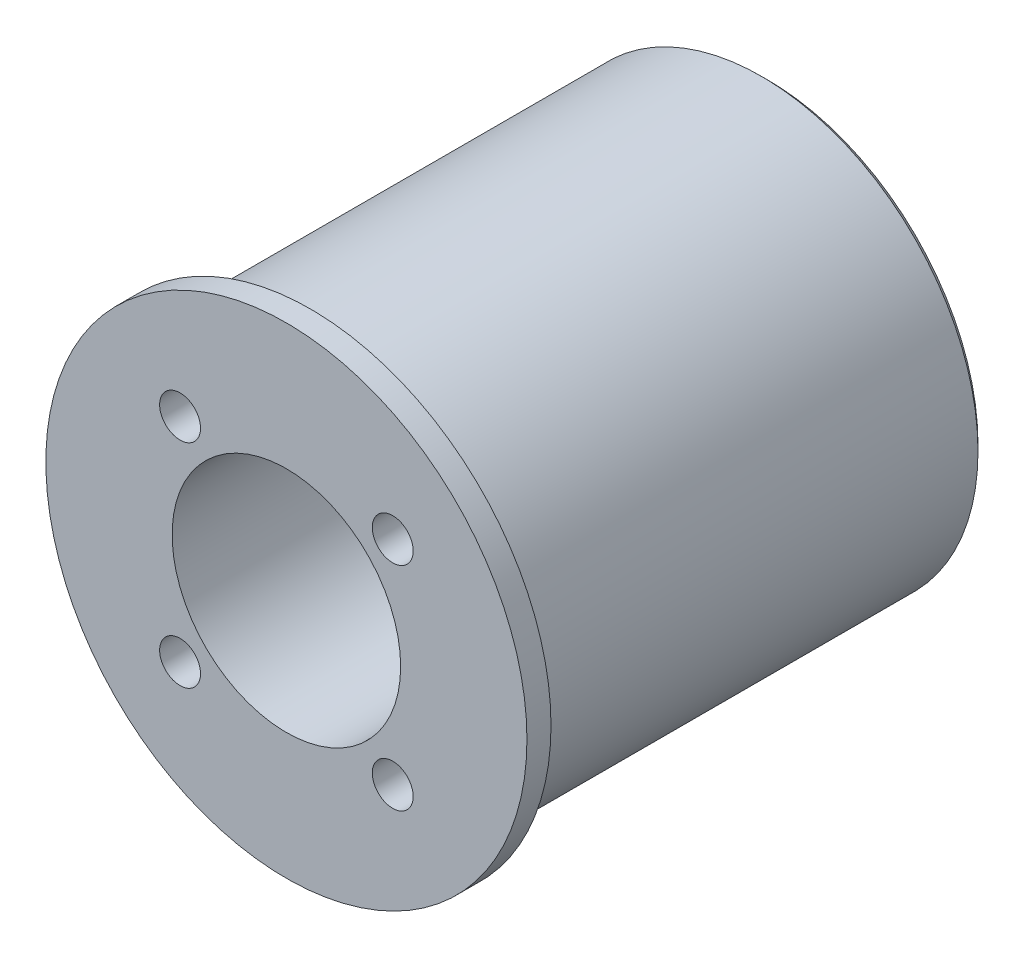
ISO-10303-21;
HEADER;
FILE_DESCRIPTION(('STEP AP214'),'2;1');
FILE_NAME('part.step','',(''),(''),'','','');
FILE_SCHEMA(('AUTOMOTIVE_DESIGN { 1 0 10303 214 1 1 1 1 }'));
ENDSEC;
DATA;
#1=APPLICATION_CONTEXT('core data for automotive mechanical design processes');
#2=APPLICATION_PROTOCOL_DEFINITION('international standard','automotive_design',2000,#1);
#3=PRODUCT_CONTEXT('',#1,'mechanical');
#4=PRODUCT('Part','Part','',(#3));
#5=PRODUCT_RELATED_PRODUCT_CATEGORY('part','',(#4));
#6=PRODUCT_DEFINITION_FORMATION('','',#4);
#7=PRODUCT_DEFINITION_CONTEXT('part definition',#1,'design');
#8=PRODUCT_DEFINITION('design','',#6,#7);
#9=PRODUCT_DEFINITION_SHAPE('','',#8);
#10=(LENGTH_UNIT() NAMED_UNIT(*) SI_UNIT(.MILLI.,.METRE.));
#11=(NAMED_UNIT(*) PLANE_ANGLE_UNIT() SI_UNIT($,.RADIAN.));
#12=(NAMED_UNIT(*) SI_UNIT($,.STERADIAN.) SOLID_ANGLE_UNIT());
#13=UNCERTAINTY_MEASURE_WITH_UNIT(LENGTH_MEASURE(1.E-05),#10,'distance_accuracy_value','');
#14=(GEOMETRIC_REPRESENTATION_CONTEXT(3) GLOBAL_UNCERTAINTY_ASSIGNED_CONTEXT((#13)) GLOBAL_UNIT_ASSIGNED_CONTEXT((#10,
#11,#12)) REPRESENTATION_CONTEXT('',''));
#15=CARTESIAN_POINT('',(0.,0.,0.));
#16=DIRECTION('',(0.,0.,1.));
#17=DIRECTION('',(1.,0.,0.));
#18=AXIS2_PLACEMENT_3D('',#15,#16,#17);
#19=CARTESIAN_POINT('',(0.,0.,40.));
#20=DIRECTION('',(0.,0.,-1.));
#21=DIRECTION('',(-1.,0.,0.));
#22=AXIS2_PLACEMENT_3D('',#19,#20,#21);
#23=CYLINDRICAL_SURFACE('',#22,18.);
#24=CARTESIAN_POINT('',(0.,0.,0.499999999999994));
#25=DIRECTION('',(0.,0.,1.));
#26=DIRECTION('',(1.,0.,0.));
#27=AXIS2_PLACEMENT_3D('',#24,#25,#26);
#28=CIRCLE('',#27,18.);
#29=CARTESIAN_POINT('',(18.,0.,0.499999999999994));
#30=VERTEX_POINT('',#29);
#31=EDGE_CURVE('E43',#30,#30,#28,.T.);
#32=ORIENTED_EDGE('',*,*,#31,.T.);
#33=EDGE_LOOP('',(#32));
#34=FACE_BOUND('',#33,.T.);
#35=CARTESIAN_POINT('',(0.,0.,38.));
#36=DIRECTION('',(0.,0.,1.));
#37=DIRECTION('',(1.,0.,0.));
#38=AXIS2_PLACEMENT_3D('',#35,#36,#37);
#39=CIRCLE('',#38,18.);
#40=CARTESIAN_POINT('',(18.,0.,38.));
#41=VERTEX_POINT('',#40);
#42=EDGE_CURVE('E47',#41,#41,#39,.T.);
#43=ORIENTED_EDGE('',*,*,#42,.F.);
#44=EDGE_LOOP('',(#43));
#45=FACE_BOUND('',#44,.T.);
#46=ADVANCED_FACE('F36',(#34,#45),#23,.T.);
#47=CARTESIAN_POINT('',(0.,0.,0.));
#48=DIRECTION('',(0.,0.,1.));
#49=DIRECTION('',(1.,0.,0.));
#50=AXIS2_PLACEMENT_3D('',#47,#48,#49);
#51=PLANE('',#50);
#52=CARTESIAN_POINT('',(0.,0.,0.));
#53=DIRECTION('',(0.,0.,1.));
#54=DIRECTION('',(1.,0.,0.));
#55=AXIS2_PLACEMENT_3D('',#52,#53,#54);
#56=CIRCLE('',#55,17.5);
#57=CARTESIAN_POINT('',(17.5,0.,0.));
#58=VERTEX_POINT('',#57);
#59=EDGE_CURVE('E11',#58,#58,#56,.F.);
#60=ORIENTED_EDGE('',*,*,#59,.T.);
#61=EDGE_LOOP('',(#60));
#62=FACE_BOUND('',#61,.T.);
#63=CARTESIAN_POINT('',(0.,0.,0.));
#64=DIRECTION('',(0.,0.,-1.));
#65=DIRECTION('',(-1.,0.,0.));
#66=AXIS2_PLACEMENT_3D('',#63,#64,#65);
#67=CIRCLE('',#66,8.);
#68=CARTESIAN_POINT('',(-8.,0.,0.));
#69=VERTEX_POINT('',#68);
#70=EDGE_CURVE('E57',#69,#69,#67,.T.);
#71=ORIENTED_EDGE('',*,*,#70,.F.);
#72=EDGE_LOOP('',(#71));
#73=FACE_BOUND('',#72,.T.);
#74=CARTESIAN_POINT('',(8.83883476483184,-8.83883476483185,0.));
#75=DIRECTION('',(0.,0.,-1.));
#76=DIRECTION('',(-1.,0.,0.));
#77=AXIS2_PLACEMENT_3D('',#74,#75,#76);
#78=CIRCLE('',#77,3.25);
#79=CARTESIAN_POINT('',(5.58883476483185,-8.83883476483185,0.));
#80=VERTEX_POINT('',#79);
#81=EDGE_CURVE('E109',#80,#80,#78,.T.);
#82=ORIENTED_EDGE('',*,*,#81,.F.);
#83=EDGE_LOOP('',(#82));
#84=FACE_BOUND('',#83,.T.);
#85=CARTESIAN_POINT('',(8.83883476483184,8.83883476483184,0.));
#86=DIRECTION('',(0.,0.,-1.));
#87=DIRECTION('',(-1.,0.,0.));
#88=AXIS2_PLACEMENT_3D('',#85,#86,#87);
#89=CIRCLE('',#88,3.25);
#90=CARTESIAN_POINT('',(5.58883476483185,8.83883476483184,0.));
#91=VERTEX_POINT('',#90);
#92=EDGE_CURVE('E97',#91,#91,#89,.T.);
#93=ORIENTED_EDGE('',*,*,#92,.F.);
#94=EDGE_LOOP('',(#93));
#95=FACE_BOUND('',#94,.T.);
#96=CARTESIAN_POINT('',(-8.83883476483185,-8.83883476483185,0.));
#97=DIRECTION('',(0.,0.,-1.));
#98=DIRECTION('',(-1.,0.,0.));
#99=AXIS2_PLACEMENT_3D('',#96,#97,#98);
#100=CIRCLE('',#99,3.25);
#101=CARTESIAN_POINT('',(-12.0888347648318,-8.83883476483185,0.));
#102=VERTEX_POINT('',#101);
#103=EDGE_CURVE('E85',#102,#102,#100,.T.);
#104=ORIENTED_EDGE('',*,*,#103,.F.);
#105=EDGE_LOOP('',(#104));
#106=FACE_BOUND('',#105,.T.);
#107=CARTESIAN_POINT('',(-8.83883476483185,8.83883476483184,0.));
#108=DIRECTION('',(0.,0.,-1.));
#109=DIRECTION('',(-1.,0.,0.));
#110=AXIS2_PLACEMENT_3D('',#107,#108,#109);
#111=CIRCLE('',#110,3.25);
#112=CARTESIAN_POINT('',(-12.0888347648318,8.83883476483184,0.));
#113=VERTEX_POINT('',#112);
#114=EDGE_CURVE('E73',#113,#113,#111,.T.);
#115=ORIENTED_EDGE('',*,*,#114,.F.);
#116=EDGE_LOOP('',(#115));
#117=FACE_BOUND('',#116,.T.);
#118=ADVANCED_FACE('F122',(#62,#73,#84,#95,#106,#117),#51,.F.);
#119=CARTESIAN_POINT('',(0.,0.,38.));
#120=DIRECTION('',(0.,0.,1.));
#121=DIRECTION('',(1.,0.,0.));
#122=AXIS2_PLACEMENT_3D('',#119,#120,#121);
#123=CYLINDRICAL_SURFACE('',#122,20.);
#124=CARTESIAN_POINT('',(0.,0.,38.));
#125=DIRECTION('',(0.,0.,1.));
#126=DIRECTION('',(1.,0.,0.));
#127=AXIS2_PLACEMENT_3D('',#124,#125,#126);
#128=CIRCLE('',#127,20.);
#129=CARTESIAN_POINT('',(20.,0.,38.));
#130=VERTEX_POINT('',#129);
#131=EDGE_CURVE('E51',#130,#130,#128,.T.);
#132=ORIENTED_EDGE('',*,*,#131,.T.);
#133=EDGE_LOOP('',(#132));
#134=FACE_BOUND('',#133,.T.);
#135=CARTESIAN_POINT('',(0.,0.,40.));
#136=DIRECTION('',(0.,0.,1.));
#137=DIRECTION('',(1.,0.,0.));
#138=AXIS2_PLACEMENT_3D('',#135,#136,#137);
#139=CIRCLE('',#138,20.);
#140=CARTESIAN_POINT('',(20.,0.,40.));
#141=VERTEX_POINT('',#140);
#142=EDGE_CURVE('E59',#141,#141,#139,.T.);
#143=ORIENTED_EDGE('',*,*,#142,.F.);
#144=EDGE_LOOP('',(#143));
#145=FACE_BOUND('',#144,.T.);
#146=ADVANCED_FACE('F125',(#134,#145),#123,.T.);
#147=CARTESIAN_POINT('',(0.,0.,38.));
#148=DIRECTION('',(0.,0.,1.));
#149=DIRECTION('',(1.,0.,0.));
#150=AXIS2_PLACEMENT_3D('',#147,#148,#149);
#151=PLANE('',#150);
#152=ORIENTED_EDGE('',*,*,#42,.T.);
#153=EDGE_LOOP('',(#152));
#154=FACE_BOUND('',#153,.T.);
#155=ORIENTED_EDGE('',*,*,#131,.F.);
#156=EDGE_LOOP('',(#155));
#157=FACE_BOUND('',#156,.T.);
#158=ADVANCED_FACE('F160',(#154,#157),#151,.F.);
#159=CARTESIAN_POINT('',(0.,0.,40.));
#160=DIRECTION('',(0.,0.,1.));
#161=DIRECTION('',(1.,0.,0.));
#162=AXIS2_PLACEMENT_3D('',#159,#160,#161);
#163=PLANE('',#162);
#164=CARTESIAN_POINT('',(0.,0.,40.));
#165=DIRECTION('',(0.,0.,1.));
#166=DIRECTION('',(1.,0.,0.));
#167=AXIS2_PLACEMENT_3D('',#164,#165,#166);
#168=CIRCLE('',#167,9.5);
#169=CARTESIAN_POINT('',(9.5,0.,40.));
#170=VERTEX_POINT('',#169);
#171=EDGE_CURVE('E56',#170,#170,#168,.T.);
#172=ORIENTED_EDGE('',*,*,#171,.F.);
#173=EDGE_LOOP('',(#172));
#174=FACE_BOUND('',#173,.T.);
#175=CARTESIAN_POINT('',(8.83883476483184,-8.83883476483185,40.));
#176=DIRECTION('',(0.,0.,-1.));
#177=DIRECTION('',(-1.,0.,0.));
#178=AXIS2_PLACEMENT_3D('',#175,#176,#177);
#179=CIRCLE('',#178,1.69999999999999);
#180=CARTESIAN_POINT('',(7.13883476483185,-8.83883476483185,40.));
#181=VERTEX_POINT('',#180);
#182=EDGE_CURVE('E100',#181,#181,#179,.T.);
#183=ORIENTED_EDGE('',*,*,#182,.T.);
#184=EDGE_LOOP('',(#183));
#185=FACE_BOUND('',#184,.T.);
#186=CARTESIAN_POINT('',(8.83883476483184,8.83883476483184,40.));
#187=DIRECTION('',(0.,0.,-1.));
#188=DIRECTION('',(-1.,0.,0.));
#189=AXIS2_PLACEMENT_3D('',#186,#187,#188);
#190=CIRCLE('',#189,1.69999999999999);
#191=CARTESIAN_POINT('',(7.13883476483185,8.83883476483184,40.));
#192=VERTEX_POINT('',#191);
#193=EDGE_CURVE('E88',#192,#192,#190,.T.);
#194=ORIENTED_EDGE('',*,*,#193,.T.);
#195=EDGE_LOOP('',(#194));
#196=FACE_BOUND('',#195,.T.);
#197=CARTESIAN_POINT('',(-8.83883476483185,-8.83883476483185,40.));
#198=DIRECTION('',(0.,0.,-1.));
#199=DIRECTION('',(-1.,0.,0.));
#200=AXIS2_PLACEMENT_3D('',#197,#198,#199);
#201=CIRCLE('',#200,1.69999999999999);
#202=CARTESIAN_POINT('',(-10.5388347648318,-8.83883476483185,40.));
#203=VERTEX_POINT('',#202);
#204=EDGE_CURVE('E76',#203,#203,#201,.T.);
#205=ORIENTED_EDGE('',*,*,#204,.T.);
#206=EDGE_LOOP('',(#205));
#207=FACE_BOUND('',#206,.T.);
#208=CARTESIAN_POINT('',(-8.83883476483185,8.83883476483184,40.));
#209=DIRECTION('',(0.,0.,-1.));
#210=DIRECTION('',(-1.,0.,0.));
#211=AXIS2_PLACEMENT_3D('',#208,#209,#210);
#212=CIRCLE('',#211,1.69999999999999);
#213=CARTESIAN_POINT('',(-10.5388347648318,8.83883476483184,40.));
#214=VERTEX_POINT('',#213);
#215=EDGE_CURVE('E62',#214,#214,#212,.T.);
#216=ORIENTED_EDGE('',*,*,#215,.T.);
#217=EDGE_LOOP('',(#216));
#218=FACE_BOUND('',#217,.T.);
#219=ORIENTED_EDGE('',*,*,#142,.T.);
#220=EDGE_LOOP('',(#219));
#221=FACE_BOUND('',#220,.T.);
#222=ADVANCED_FACE('F157',(#174,#185,#196,#207,#218,#221),#163,.T.);
#223=CARTESIAN_POINT('',(-8.83883476483185,8.83883476483184,0.));
#224=DIRECTION('',(0.,0.,-1.));
#225=DIRECTION('',(-1.,0.,0.));
#226=AXIS2_PLACEMENT_3D('',#223,#224,#225);
#227=CYLINDRICAL_SURFACE('',#226,1.7);
#228=ORIENTED_EDGE('',*,*,#215,.F.);
#229=EDGE_LOOP('',(#228));
#230=FACE_BOUND('',#229,.T.);
#231=CARTESIAN_POINT('',(-8.83883476483185,8.83883476483184,3.4));
#232=DIRECTION('',(0.,0.,-1.));
#233=DIRECTION('',(-1.,0.,0.));
#234=AXIS2_PLACEMENT_3D('',#231,#232,#233);
#235=CIRCLE('',#234,1.7);
#236=CARTESIAN_POINT('',(-10.5388347648319,8.83883476483184,3.4));
#237=VERTEX_POINT('',#236);
#238=EDGE_CURVE('E67',#237,#237,#235,.T.);
#239=ORIENTED_EDGE('',*,*,#238,.T.);
#240=EDGE_LOOP('',(#239));
#241=FACE_BOUND('',#240,.T.);
#242=ADVANCED_FACE('F148',(#230,#241),#227,.F.);
#243=CARTESIAN_POINT('',(-7.13883476483184,8.83883476483184,3.4));
#244=DIRECTION('',(0.,0.,1.));
#245=DIRECTION('',(1.,0.,0.));
#246=AXIS2_PLACEMENT_3D('',#243,#244,#245);
#247=PLANE('',#246);
#248=ORIENTED_EDGE('',*,*,#238,.F.);
#249=EDGE_LOOP('',(#248));
#250=FACE_BOUND('',#249,.T.);
#251=CARTESIAN_POINT('',(-8.83883476483185,8.83883476483184,3.4));
#252=DIRECTION('',(0.,0.,-1.));
#253=DIRECTION('',(-1.,0.,0.));
#254=AXIS2_PLACEMENT_3D('',#251,#252,#253);
#255=CIRCLE('',#254,3.25);
#256=CARTESIAN_POINT('',(-12.0888347648318,8.83883476483184,3.4));
#257=VERTEX_POINT('',#256);
#258=EDGE_CURVE('E70',#257,#257,#255,.T.);
#259=ORIENTED_EDGE('',*,*,#258,.T.);
#260=EDGE_LOOP('',(#259));
#261=FACE_BOUND('',#260,.T.);
#262=ADVANCED_FACE('F138',(#250,#261),#247,.F.);
#263=CARTESIAN_POINT('',(-8.83883476483185,8.83883476483184,0.));
#264=DIRECTION('',(0.,0.,-1.));
#265=DIRECTION('',(-1.,0.,0.));
#266=AXIS2_PLACEMENT_3D('',#263,#264,#265);
#267=CYLINDRICAL_SURFACE('',#266,3.25);
#268=ORIENTED_EDGE('',*,*,#258,.F.);
#269=EDGE_LOOP('',(#268));
#270=FACE_BOUND('',#269,.T.);
#271=ORIENTED_EDGE('',*,*,#114,.T.);
#272=EDGE_LOOP('',(#271));
#273=FACE_BOUND('',#272,.T.);
#274=ADVANCED_FACE('F135',(#270,#273),#267,.F.);
#275=CARTESIAN_POINT('',(-8.83883476483185,-8.83883476483185,0.));
#276=DIRECTION('',(0.,0.,-1.));
#277=DIRECTION('',(-1.,0.,0.));
#278=AXIS2_PLACEMENT_3D('',#275,#276,#277);
#279=CYLINDRICAL_SURFACE('',#278,1.7);
#280=ORIENTED_EDGE('',*,*,#204,.F.);
#281=EDGE_LOOP('',(#280));
#282=FACE_BOUND('',#281,.T.);
#283=CARTESIAN_POINT('',(-8.83883476483185,-8.83883476483185,3.4));
#284=DIRECTION('',(0.,0.,-1.));
#285=DIRECTION('',(-1.,0.,0.));
#286=AXIS2_PLACEMENT_3D('',#283,#284,#285);
#287=CIRCLE('',#286,1.7);
#288=CARTESIAN_POINT('',(-10.5388347648319,-8.83883476483185,3.4));
#289=VERTEX_POINT('',#288);
#290=EDGE_CURVE('E79',#289,#289,#287,.T.);
#291=ORIENTED_EDGE('',*,*,#290,.T.);
#292=EDGE_LOOP('',(#291));
#293=FACE_BOUND('',#292,.T.);
#294=ADVANCED_FACE('F137',(#282,#293),#279,.F.);
#295=CARTESIAN_POINT('',(-7.13883476483184,-8.83883476483185,3.4));
#296=DIRECTION('',(0.,0.,1.));
#297=DIRECTION('',(1.,0.,0.));
#298=AXIS2_PLACEMENT_3D('',#295,#296,#297);
#299=PLANE('',#298);
#300=ORIENTED_EDGE('',*,*,#290,.F.);
#301=EDGE_LOOP('',(#300));
#302=FACE_BOUND('',#301,.T.);
#303=CARTESIAN_POINT('',(-8.83883476483185,-8.83883476483185,3.4));
#304=DIRECTION('',(0.,0.,-1.));
#305=DIRECTION('',(-1.,0.,0.));
#306=AXIS2_PLACEMENT_3D('',#303,#304,#305);
#307=CIRCLE('',#306,3.25);
#308=CARTESIAN_POINT('',(-12.0888347648318,-8.83883476483185,3.4));
#309=VERTEX_POINT('',#308);
#310=EDGE_CURVE('E82',#309,#309,#307,.T.);
#311=ORIENTED_EDGE('',*,*,#310,.T.);
#312=EDGE_LOOP('',(#311));
#313=FACE_BOUND('',#312,.T.);
#314=ADVANCED_FACE('F145',(#302,#313),#299,.F.);
#315=CARTESIAN_POINT('',(-8.83883476483185,-8.83883476483185,0.));
#316=DIRECTION('',(0.,0.,-1.));
#317=DIRECTION('',(-1.,0.,0.));
#318=AXIS2_PLACEMENT_3D('',#315,#316,#317);
#319=CYLINDRICAL_SURFACE('',#318,3.25);
#320=ORIENTED_EDGE('',*,*,#310,.F.);
#321=EDGE_LOOP('',(#320));
#322=FACE_BOUND('',#321,.T.);
#323=ORIENTED_EDGE('',*,*,#103,.T.);
#324=EDGE_LOOP('',(#323));
#325=FACE_BOUND('',#324,.T.);
#326=ADVANCED_FACE('F206',(#322,#325),#319,.F.);
#327=CARTESIAN_POINT('',(8.83883476483184,8.83883476483184,0.));
#328=DIRECTION('',(0.,0.,-1.));
#329=DIRECTION('',(-1.,0.,0.));
#330=AXIS2_PLACEMENT_3D('',#327,#328,#329);
#331=CYLINDRICAL_SURFACE('',#330,1.7);
#332=ORIENTED_EDGE('',*,*,#193,.F.);
#333=EDGE_LOOP('',(#332));
#334=FACE_BOUND('',#333,.T.);
#335=CARTESIAN_POINT('',(8.83883476483184,8.83883476483184,3.4));
#336=DIRECTION('',(0.,0.,-1.));
#337=DIRECTION('',(-1.,0.,0.));
#338=AXIS2_PLACEMENT_3D('',#335,#336,#337);
#339=CIRCLE('',#338,1.7);
#340=CARTESIAN_POINT('',(7.13883476483184,8.83883476483184,3.4));
#341=VERTEX_POINT('',#340);
#342=EDGE_CURVE('E91',#341,#341,#339,.T.);
#343=ORIENTED_EDGE('',*,*,#342,.T.);
#344=EDGE_LOOP('',(#343));
#345=FACE_BOUND('',#344,.T.);
#346=ADVANCED_FACE('F216',(#334,#345),#331,.F.);
#347=CARTESIAN_POINT('',(10.5388347648318,8.83883476483184,3.4));
#348=DIRECTION('',(0.,0.,1.));
#349=DIRECTION('',(1.,0.,0.));
#350=AXIS2_PLACEMENT_3D('',#347,#348,#349);
#351=PLANE('',#350);
#352=ORIENTED_EDGE('',*,*,#342,.F.);
#353=EDGE_LOOP('',(#352));
#354=FACE_BOUND('',#353,.T.);
#355=CARTESIAN_POINT('',(8.83883476483184,8.83883476483184,3.4));
#356=DIRECTION('',(0.,0.,-1.));
#357=DIRECTION('',(-1.,0.,0.));
#358=AXIS2_PLACEMENT_3D('',#355,#356,#357);
#359=CIRCLE('',#358,3.25);
#360=CARTESIAN_POINT('',(5.58883476483184,8.83883476483184,3.4));
#361=VERTEX_POINT('',#360);
#362=EDGE_CURVE('E94',#361,#361,#359,.T.);
#363=ORIENTED_EDGE('',*,*,#362,.T.);
#364=EDGE_LOOP('',(#363));
#365=FACE_BOUND('',#364,.T.);
#366=ADVANCED_FACE('F226',(#354,#365),#351,.F.);
#367=CARTESIAN_POINT('',(8.83883476483184,8.83883476483184,0.));
#368=DIRECTION('',(0.,0.,-1.));
#369=DIRECTION('',(-1.,0.,0.));
#370=AXIS2_PLACEMENT_3D('',#367,#368,#369);
#371=CYLINDRICAL_SURFACE('',#370,3.25);
#372=ORIENTED_EDGE('',*,*,#362,.F.);
#373=EDGE_LOOP('',(#372));
#374=FACE_BOUND('',#373,.T.);
#375=ORIENTED_EDGE('',*,*,#92,.T.);
#376=EDGE_LOOP('',(#375));
#377=FACE_BOUND('',#376,.T.);
#378=ADVANCED_FACE('F236',(#374,#377),#371,.F.);
#379=CARTESIAN_POINT('',(8.83883476483184,-8.83883476483185,0.));
#380=DIRECTION('',(0.,0.,-1.));
#381=DIRECTION('',(-1.,0.,0.));
#382=AXIS2_PLACEMENT_3D('',#379,#380,#381);
#383=CYLINDRICAL_SURFACE('',#382,1.7);
#384=ORIENTED_EDGE('',*,*,#182,.F.);
#385=EDGE_LOOP('',(#384));
#386=FACE_BOUND('',#385,.T.);
#387=CARTESIAN_POINT('',(8.83883476483184,-8.83883476483185,3.4));
#388=DIRECTION('',(0.,0.,-1.));
#389=DIRECTION('',(-1.,0.,0.));
#390=AXIS2_PLACEMENT_3D('',#387,#388,#389);
#391=CIRCLE('',#390,1.7);
#392=CARTESIAN_POINT('',(7.13883476483184,-8.83883476483185,3.4));
#393=VERTEX_POINT('',#392);
#394=EDGE_CURVE('E103',#393,#393,#391,.T.);
#395=ORIENTED_EDGE('',*,*,#394,.T.);
#396=EDGE_LOOP('',(#395));
#397=FACE_BOUND('',#396,.T.);
#398=ADVANCED_FACE('F246',(#386,#397),#383,.F.);
#399=CARTESIAN_POINT('',(10.5388347648318,-8.83883476483185,3.4));
#400=DIRECTION('',(0.,0.,1.));
#401=DIRECTION('',(1.,0.,0.));
#402=AXIS2_PLACEMENT_3D('',#399,#400,#401);
#403=PLANE('',#402);
#404=ORIENTED_EDGE('',*,*,#394,.F.);
#405=EDGE_LOOP('',(#404));
#406=FACE_BOUND('',#405,.T.);
#407=CARTESIAN_POINT('',(8.83883476483184,-8.83883476483185,3.4));
#408=DIRECTION('',(0.,0.,-1.));
#409=DIRECTION('',(-1.,0.,0.));
#410=AXIS2_PLACEMENT_3D('',#407,#408,#409);
#411=CIRCLE('',#410,3.25);
#412=CARTESIAN_POINT('',(5.58883476483184,-8.83883476483185,3.4));
#413=VERTEX_POINT('',#412);
#414=EDGE_CURVE('E106',#413,#413,#411,.T.);
#415=ORIENTED_EDGE('',*,*,#414,.T.);
#416=EDGE_LOOP('',(#415));
#417=FACE_BOUND('',#416,.T.);
#418=ADVANCED_FACE('F256',(#406,#417),#403,.F.);
#419=CARTESIAN_POINT('',(8.83883476483184,-8.83883476483185,0.));
#420=DIRECTION('',(0.,0.,-1.));
#421=DIRECTION('',(-1.,0.,0.));
#422=AXIS2_PLACEMENT_3D('',#419,#420,#421);
#423=CYLINDRICAL_SURFACE('',#422,3.25);
#424=ORIENTED_EDGE('',*,*,#414,.F.);
#425=EDGE_LOOP('',(#424));
#426=FACE_BOUND('',#425,.T.);
#427=ORIENTED_EDGE('',*,*,#81,.T.);
#428=EDGE_LOOP('',(#427));
#429=FACE_BOUND('',#428,.T.);
#430=ADVANCED_FACE('F266',(#426,#429),#423,.F.);
#431=CARTESIAN_POINT('',(0.,0.,5.));
#432=DIRECTION('',(0.,0.,1.));
#433=DIRECTION('',(1.,0.,0.));
#434=AXIS2_PLACEMENT_3D('',#431,#432,#433);
#435=PLANE('',#434);
#436=CARTESIAN_POINT('',(0.,0.,5.));
#437=DIRECTION('',(0.,0.,1.));
#438=DIRECTION('',(1.,0.,0.));
#439=AXIS2_PLACEMENT_3D('',#436,#437,#438);
#440=CIRCLE('',#439,8.);
#441=CARTESIAN_POINT('',(8.,0.,5.));
#442=VERTEX_POINT('',#441);
#443=EDGE_CURVE('E54',#442,#442,#440,.T.);
#444=ORIENTED_EDGE('',*,*,#443,.F.);
#445=EDGE_LOOP('',(#444));
#446=FACE_BOUND('',#445,.T.);
#447=CARTESIAN_POINT('',(0.,0.,5.));
#448=DIRECTION('',(0.,0.,1.));
#449=DIRECTION('',(1.,0.,0.));
#450=AXIS2_PLACEMENT_3D('',#447,#448,#449);
#451=CIRCLE('',#450,9.5);
#452=CARTESIAN_POINT('',(9.5,0.,5.));
#453=VERTEX_POINT('',#452);
#454=EDGE_CURVE('E112',#453,#453,#451,.F.);
#455=ORIENTED_EDGE('',*,*,#454,.F.);
#456=EDGE_LOOP('',(#455));
#457=FACE_BOUND('',#456,.T.);
#458=ADVANCED_FACE('F275',(#446,#457),#435,.T.);
#459=CARTESIAN_POINT('',(0.,0.,-26.8700576850888));
#460=DIRECTION('',(0.,0.,1.));
#461=DIRECTION('',(1.,0.,0.));
#462=AXIS2_PLACEMENT_3D('',#459,#460,#461);
#463=CYLINDRICAL_SURFACE('',#462,9.5);
#464=ORIENTED_EDGE('',*,*,#454,.T.);
#465=EDGE_LOOP('',(#464));
#466=FACE_BOUND('',#465,.T.);
#467=ORIENTED_EDGE('',*,*,#171,.T.);
#468=EDGE_LOOP('',(#467));
#469=FACE_BOUND('',#468,.T.);
#470=ADVANCED_FACE('F290',(#466,#469),#463,.F.);
#471=CARTESIAN_POINT('',(0.,0.,40.));
#472=DIRECTION('',(0.,0.,-1.));
#473=DIRECTION('',(-1.,0.,0.));
#474=AXIS2_PLACEMENT_3D('',#471,#472,#473);
#475=CYLINDRICAL_SURFACE('',#474,8.);
#476=ORIENTED_EDGE('',*,*,#443,.T.);
#477=EDGE_LOOP('',(#476));
#478=FACE_BOUND('',#477,.T.);
#479=ORIENTED_EDGE('',*,*,#70,.T.);
#480=EDGE_LOOP('',(#479));
#481=FACE_BOUND('',#480,.T.);
#482=ADVANCED_FACE('F120',(#478,#481),#475,.F.);
#483=CARTESIAN_POINT('',(0.,0.,0.499999999999994));
#484=DIRECTION('',(0.,0.,1.));
#485=DIRECTION('',(1.,0.,0.));
#486=AXIS2_PLACEMENT_3D('',#483,#484,#485);
#487=CONICAL_SURFACE('',#486,18.,0.785398163397452);
#488=ORIENTED_EDGE('',*,*,#59,.F.);
#489=EDGE_LOOP('',(#488));
#490=FACE_BOUND('',#489,.T.);
#491=ORIENTED_EDGE('',*,*,#31,.F.);
#492=EDGE_LOOP('',(#491));
#493=FACE_BOUND('',#492,.T.);
#494=ADVANCED_FACE('F38',(#490,#493),#487,.T.);
#495=CLOSED_SHELL('',(#46,#118,#146,#158,#222,#242,#262,#274,#294,#314,#326,#346,#366,#378,#398,
#418,#430,#458,#470,#482,#494));
#496=MANIFOLD_SOLID_BREP('B2',#495);
#497=ADVANCED_BREP_SHAPE_REPRESENTATION('',(#18,#496),#14);
#498=SHAPE_DEFINITION_REPRESENTATION(#9,#497);
ENDSEC;
END-ISO-10303-21;
